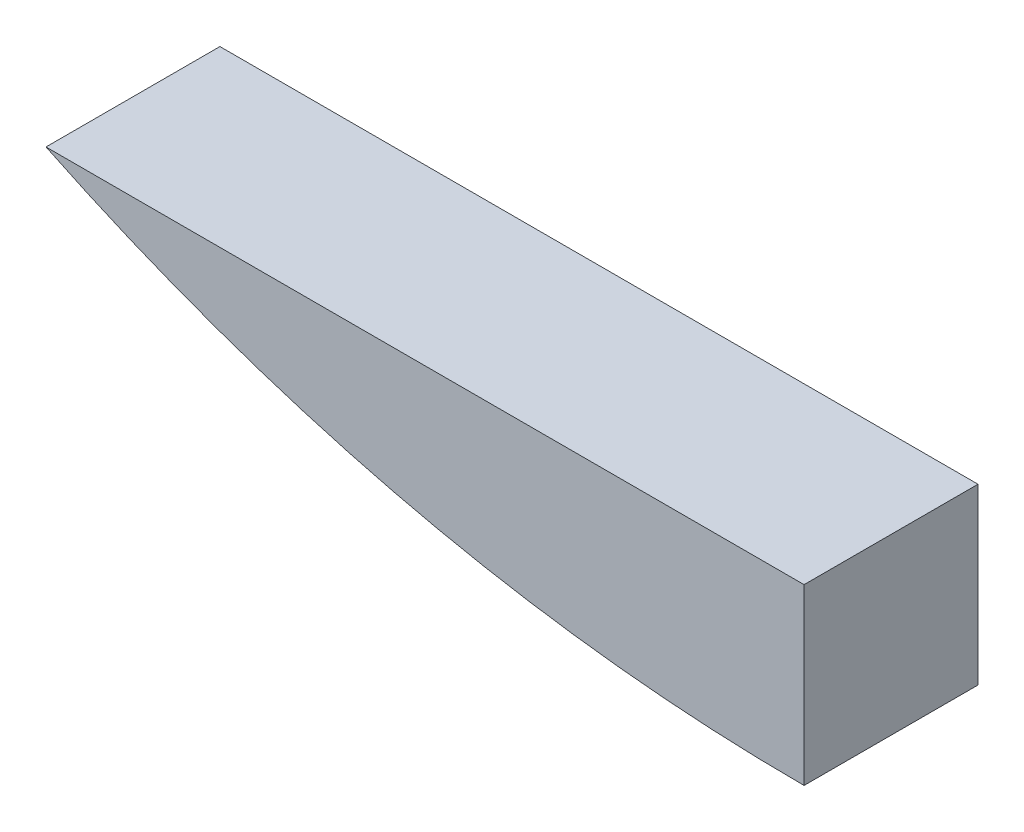
ISO-10303-21;
HEADER;
FILE_DESCRIPTION(('STEP AP214'),'2;1');
FILE_NAME('part.step','',(''),(''),'','','');
FILE_SCHEMA(('AUTOMOTIVE_DESIGN { 1 0 10303 214 1 1 1 1 }'));
ENDSEC;
DATA;
#1=APPLICATION_CONTEXT('core data for automotive mechanical design processes');
#2=APPLICATION_PROTOCOL_DEFINITION('international standard','automotive_design',2000,#1);
#3=PRODUCT_CONTEXT('',#1,'mechanical');
#4=PRODUCT('Part','Part','',(#3));
#5=PRODUCT_RELATED_PRODUCT_CATEGORY('part','',(#4));
#6=PRODUCT_DEFINITION_FORMATION('','',#4);
#7=PRODUCT_DEFINITION_CONTEXT('part definition',#1,'design');
#8=PRODUCT_DEFINITION('design','',#6,#7);
#9=PRODUCT_DEFINITION_SHAPE('','',#8);
#10=(LENGTH_UNIT() NAMED_UNIT(*) SI_UNIT(.MILLI.,.METRE.));
#11=(NAMED_UNIT(*) PLANE_ANGLE_UNIT() SI_UNIT($,.RADIAN.));
#12=(NAMED_UNIT(*) SI_UNIT($,.STERADIAN.) SOLID_ANGLE_UNIT());
#13=UNCERTAINTY_MEASURE_WITH_UNIT(LENGTH_MEASURE(1.E-05),#10,'distance_accuracy_value','');
#14=(GEOMETRIC_REPRESENTATION_CONTEXT(3) GLOBAL_UNCERTAINTY_ASSIGNED_CONTEXT((#13)) GLOBAL_UNIT_ASSIGNED_CONTEXT((#10,
#11,#12)) REPRESENTATION_CONTEXT('',''));
#15=CARTESIAN_POINT('',(0.,0.,0.));
#16=DIRECTION('',(0.,0.,1.));
#17=DIRECTION('',(1.,0.,0.));
#18=AXIS2_PLACEMENT_3D('',#15,#16,#17);
#19=CARTESIAN_POINT('',(-502.733741957931,0.,0.));
#20=DIRECTION('',(1.,0.,0.));
#21=DIRECTION('',(0.,0.,-1.));
#22=AXIS2_PLACEMENT_3D('',#19,#20,#21);
#23=PLANE('',#22);
#24=DIRECTION('',(0.,0.,-1.));
#25=VECTOR('',#24,1.);
#26=CARTESIAN_POINT('',(-502.733741957931,-50.,80.));
#27=LINE('',#26,#25);
#28=CARTESIAN_POINT('',(-502.733741957931,-50.,5.));
#29=VERTEX_POINT('',#28);
#30=CARTESIAN_POINT('',(-502.733741957931,-50.,0.));
#31=VERTEX_POINT('',#30);
#32=EDGE_CURVE('E73',#29,#31,#27,.T.);
#33=ORIENTED_EDGE('',*,*,#32,.T.);
#34=DIRECTION('',(0.,1.,0.));
#35=VECTOR('',#34,1.);
#36=CARTESIAN_POINT('',(-502.733741957931,0.,0.));
#37=LINE('',#36,#35);
#38=CARTESIAN_POINT('',(-502.733741957931,-45.,0.));
#39=VERTEX_POINT('',#38);
#40=EDGE_CURVE('E79',#31,#39,#37,.T.);
#41=ORIENTED_EDGE('',*,*,#40,.T.);
#42=DIRECTION('',(0.,0.,-1.));
#43=VECTOR('',#42,1.);
#44=CARTESIAN_POINT('',(-502.733741957931,-45.,0.));
#45=LINE('',#44,#43);
#46=CARTESIAN_POINT('',(-502.733741957931,-45.,5.));
#47=VERTEX_POINT('',#46);
#48=EDGE_CURVE('E83',#47,#39,#45,.T.);
#49=ORIENTED_EDGE('',*,*,#48,.F.);
#50=DIRECTION('',(0.,1.,0.));
#51=VECTOR('',#50,1.);
#52=CARTESIAN_POINT('',(-502.733741957931,-45.,5.));
#53=LINE('',#52,#51);
#54=EDGE_CURVE('E76',#29,#47,#53,.T.);
#55=ORIENTED_EDGE('',*,*,#54,.F.);
#56=EDGE_LOOP('',(#33,#41,#49,#55));
#57=FACE_BOUND('',#56,.T.);
#58=ADVANCED_FACE('F34',(#57),#23,.T.);
#59=CARTESIAN_POINT('',(-502.733741957931,0.,0.));
#60=DIRECTION('',(0.,0.,1.));
#61=DIRECTION('',(1.,0.,0.));
#62=AXIS2_PLACEMENT_3D('',#59,#60,#61);
#63=PLANE('',#62);
#64=ORIENTED_EDGE('',*,*,#40,.F.);
#65=CARTESIAN_POINT('',(-502.733741957931,0.,0.));
#66=DIRECTION('',(0.,0.,1.));
#67=DIRECTION('',(1.,0.,0.));
#68=AXIS2_PLACEMENT_3D('',#65,#66,#67);
#69=CIRCLE('',#68,50.);
#70=CARTESIAN_POINT('',(-524.528236675635,-45.,0.));
#71=VERTEX_POINT('',#70);
#72=EDGE_CURVE('E68',#71,#31,#69,.T.);
#73=ORIENTED_EDGE('',*,*,#72,.F.);
#74=DIRECTION('',(-1.,0.,0.));
#75=VECTOR('',#74,1.);
#76=CARTESIAN_POINT('',(-502.733741957931,-45.,0.));
#77=LINE('',#76,#75);
#78=EDGE_CURVE('E38',#39,#71,#77,.T.);
#79=ORIENTED_EDGE('',*,*,#78,.F.);
#80=EDGE_LOOP('',(#64,#73,#79));
#81=FACE_BOUND('',#80,.T.);
#82=ADVANCED_FACE('F80',(#81),#63,.F.);
#83=CARTESIAN_POINT('',(0.,-45.,0.));
#84=DIRECTION('',(0.,1.,0.));
#85=DIRECTION('',(0.,0.,1.));
#86=AXIS2_PLACEMENT_3D('',#83,#84,#85);
#87=PLANE('',#86);
#88=DIRECTION('',(-1.,0.,0.));
#89=VECTOR('',#88,1.);
#90=CARTESIAN_POINT('',(597.266258042068,-45.,5.));
#91=LINE('',#90,#89);
#92=CARTESIAN_POINT('',(-524.528236675635,-45.,5.));
#93=VERTEX_POINT('',#92);
#94=EDGE_CURVE('E56',#47,#93,#91,.T.);
#95=ORIENTED_EDGE('',*,*,#94,.F.);
#96=ORIENTED_EDGE('',*,*,#48,.T.);
#97=ORIENTED_EDGE('',*,*,#78,.T.);
#98=DIRECTION('',(0.,0.,-1.));
#99=VECTOR('',#98,1.);
#100=CARTESIAN_POINT('',(-524.528236675635,-45.,80.));
#101=LINE('',#100,#99);
#102=EDGE_CURVE('E11',#71,#93,#101,.F.);
#103=ORIENTED_EDGE('',*,*,#102,.T.);
#104=EDGE_LOOP('',(#95,#96,#97,#103));
#105=FACE_BOUND('',#104,.T.);
#106=ADVANCED_FACE('F90',(#105),#87,.T.);
#107=CARTESIAN_POINT('',(-502.733741957931,0.,80.));
#108=DIRECTION('',(0.,0.,-1.));
#109=DIRECTION('',(-1.,0.,0.));
#110=AXIS2_PLACEMENT_3D('',#107,#108,#109);
#111=CYLINDRICAL_SURFACE('',#110,50.);
#112=ORIENTED_EDGE('',*,*,#102,.F.);
#113=ORIENTED_EDGE('',*,*,#72,.T.);
#114=ORIENTED_EDGE('',*,*,#32,.F.);
#115=CARTESIAN_POINT('',(-502.733741957931,0.,5.));
#116=DIRECTION('',(0.,0.,1.));
#117=DIRECTION('',(1.,0.,0.));
#118=AXIS2_PLACEMENT_3D('',#115,#116,#117);
#119=CIRCLE('',#118,50.);
#120=EDGE_CURVE('E75',#93,#29,#119,.T.);
#121=ORIENTED_EDGE('',*,*,#120,.F.);
#122=EDGE_LOOP('',(#112,#113,#114,#121));
#123=FACE_BOUND('',#122,.T.);
#124=ADVANCED_FACE('F70',(#123),#111,.T.);
#125=CARTESIAN_POINT('',(597.266258042068,-45.,5.));
#126=DIRECTION('',(0.,0.,1.));
#127=DIRECTION('',(1.,0.,0.));
#128=AXIS2_PLACEMENT_3D('',#125,#126,#127);
#129=PLANE('',#128);
#130=ORIENTED_EDGE('',*,*,#120,.T.);
#131=ORIENTED_EDGE('',*,*,#54,.T.);
#132=ORIENTED_EDGE('',*,*,#94,.T.);
#133=EDGE_LOOP('',(#130,#131,#132));
#134=FACE_BOUND('',#133,.T.);
#135=ADVANCED_FACE('F36',(#134),#129,.T.);
#136=CLOSED_SHELL('',(#58,#82,#106,#124,#135));
#137=MANIFOLD_SOLID_BREP('B2',#136);
#138=ADVANCED_BREP_SHAPE_REPRESENTATION('',(#18,#137),#14);
#139=SHAPE_DEFINITION_REPRESENTATION(#9,#138);
ENDSEC;
END-ISO-10303-21;
